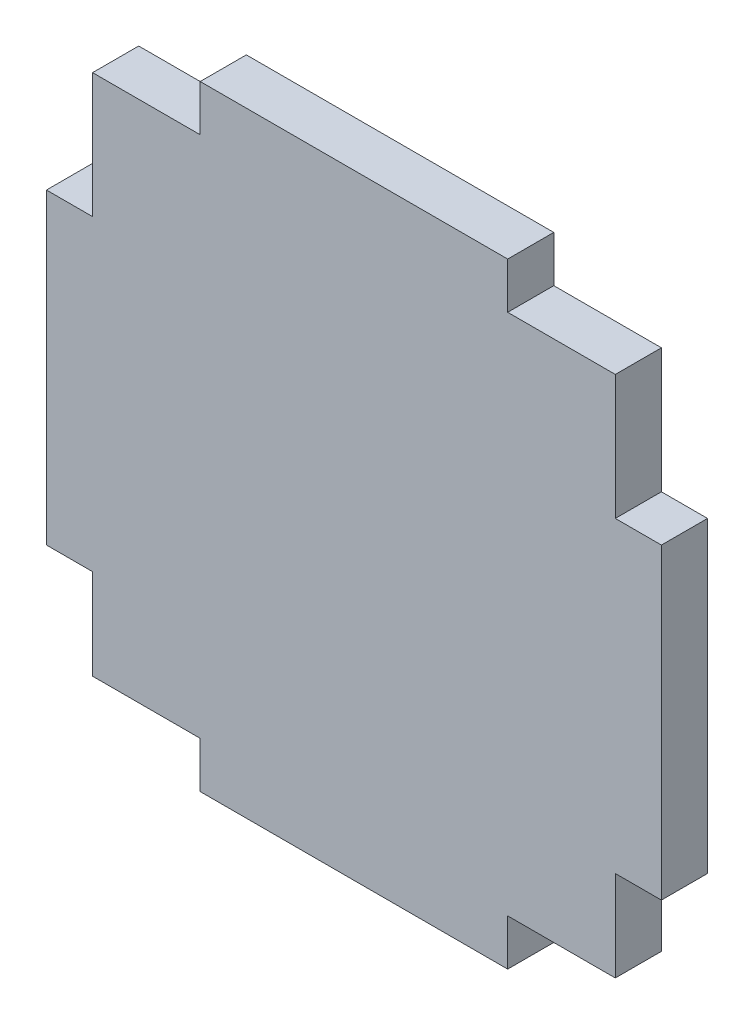
ISO-10303-21;
HEADER;
FILE_DESCRIPTION(('STEP AP214'),'2;1');
FILE_NAME('part.step','',(''),(''),'','','');
FILE_SCHEMA(('AUTOMOTIVE_DESIGN { 1 0 10303 214 1 1 1 1 }'));
ENDSEC;
DATA;
#1=APPLICATION_CONTEXT('core data for automotive mechanical design processes');
#2=APPLICATION_PROTOCOL_DEFINITION('international standard','automotive_design',2000,#1);
#3=PRODUCT_CONTEXT('',#1,'mechanical');
#4=PRODUCT('Part','Part','',(#3));
#5=PRODUCT_RELATED_PRODUCT_CATEGORY('part','',(#4));
#6=PRODUCT_DEFINITION_FORMATION('','',#4);
#7=PRODUCT_DEFINITION_CONTEXT('part definition',#1,'design');
#8=PRODUCT_DEFINITION('design','',#6,#7);
#9=PRODUCT_DEFINITION_SHAPE('','',#8);
#10=(LENGTH_UNIT() NAMED_UNIT(*) SI_UNIT(.MILLI.,.METRE.));
#11=(NAMED_UNIT(*) PLANE_ANGLE_UNIT() SI_UNIT($,.RADIAN.));
#12=(NAMED_UNIT(*) SI_UNIT($,.STERADIAN.) SOLID_ANGLE_UNIT());
#13=UNCERTAINTY_MEASURE_WITH_UNIT(LENGTH_MEASURE(1.E-05),#10,'distance_accuracy_value','');
#14=(GEOMETRIC_REPRESENTATION_CONTEXT(3) GLOBAL_UNCERTAINTY_ASSIGNED_CONTEXT((#13)) GLOBAL_UNIT_ASSIGNED_CONTEXT((#10,
#11,#12)) REPRESENTATION_CONTEXT('',''));
#15=CARTESIAN_POINT('',(0.,0.,0.));
#16=DIRECTION('',(0.,0.,1.));
#17=DIRECTION('',(1.,0.,0.));
#18=AXIS2_PLACEMENT_3D('',#15,#16,#17);
#19=CARTESIAN_POINT('',(103.773892478663,-53.6986126238286,3.));
#20=DIRECTION('',(0.,1.,0.));
#21=DIRECTION('',(0.,0.,1.));
#22=AXIS2_PLACEMENT_3D('',#19,#20,#21);
#23=PLANE('',#22);
#24=DIRECTION('',(1.,0.,0.));
#25=VECTOR('',#24,1.);
#26=CARTESIAN_POINT('',(103.773892478663,-53.6986126238286,0.));
#27=LINE('',#26,#25);
#28=CARTESIAN_POINT('',(103.773892478663,-53.6986126238286,0.));
#29=VERTEX_POINT('',#28);
#30=CARTESIAN_POINT('',(110.773892478663,-53.6986126238286,0.));
#31=VERTEX_POINT('',#30);
#32=EDGE_CURVE('E205',#29,#31,#27,.T.);
#33=ORIENTED_EDGE('',*,*,#32,.T.);
#34=DIRECTION('',(0.,0.,-1.));
#35=VECTOR('',#34,1.);
#36=CARTESIAN_POINT('',(110.773892478663,-53.6986126238286,3.));
#37=LINE('',#36,#35);
#38=CARTESIAN_POINT('',(110.773892478663,-53.6986126238286,3.));
#39=VERTEX_POINT('',#38);
#40=EDGE_CURVE('E11',#39,#31,#37,.T.);
#41=ORIENTED_EDGE('',*,*,#40,.F.);
#42=DIRECTION('',(1.,0.,0.));
#43=VECTOR('',#42,1.);
#44=CARTESIAN_POINT('',(103.773892478663,-53.6986126238286,3.));
#45=LINE('',#44,#43);
#46=CARTESIAN_POINT('',(103.773892478663,-53.6986126238286,3.));
#47=VERTEX_POINT('',#46);
#48=EDGE_CURVE('E243',#47,#39,#45,.T.);
#49=ORIENTED_EDGE('',*,*,#48,.F.);
#50=DIRECTION('',(0.,0.,-1.));
#51=VECTOR('',#50,1.);
#52=CARTESIAN_POINT('',(103.773892478663,-53.6986126238286,3.));
#53=LINE('',#52,#51);
#54=EDGE_CURVE('E201',#47,#29,#53,.T.);
#55=ORIENTED_EDGE('',*,*,#54,.T.);
#56=EDGE_LOOP('',(#33,#41,#49,#55));
#57=FACE_BOUND('',#56,.T.);
#58=ADVANCED_FACE('F37',(#57),#23,.F.);
#59=CARTESIAN_POINT('',(110.773892478663,-47.8105206645095,3.));
#60=DIRECTION('',(-1.,0.,0.));
#61=DIRECTION('',(0.,0.,1.));
#62=AXIS2_PLACEMENT_3D('',#59,#60,#61);
#63=PLANE('',#62);
#64=DIRECTION('',(0.,1.,0.));
#65=VECTOR('',#64,1.);
#66=CARTESIAN_POINT('',(110.773892478663,-47.8105206645095,0.));
#67=LINE('',#66,#65);
#68=CARTESIAN_POINT('',(110.773892478663,-47.8105206645095,0.));
#69=VERTEX_POINT('',#68);
#70=EDGE_CURVE('E208',#31,#69,#67,.T.);
#71=ORIENTED_EDGE('',*,*,#70,.T.);
#72=DIRECTION('',(0.,0.,-1.));
#73=VECTOR('',#72,1.);
#74=CARTESIAN_POINT('',(110.773892478663,-47.8105206645095,3.));
#75=LINE('',#74,#73);
#76=CARTESIAN_POINT('',(110.773892478663,-47.8105206645095,3.));
#77=VERTEX_POINT('',#76);
#78=EDGE_CURVE('E45',#77,#69,#75,.T.);
#79=ORIENTED_EDGE('',*,*,#78,.F.);
#80=DIRECTION('',(0.,1.,0.));
#81=VECTOR('',#80,1.);
#82=CARTESIAN_POINT('',(110.773892478663,-47.8105206645095,3.));
#83=LINE('',#82,#81);
#84=EDGE_CURVE('E132',#39,#77,#83,.T.);
#85=ORIENTED_EDGE('',*,*,#84,.F.);
#86=ORIENTED_EDGE('',*,*,#40,.T.);
#87=EDGE_LOOP('',(#71,#79,#85,#86));
#88=FACE_BOUND('',#87,.T.);
#89=ADVANCED_FACE('F361',(#88),#63,.F.);
#90=CARTESIAN_POINT('',(113.773892478663,-47.8105206645095,3.));
#91=DIRECTION('',(0.,1.,0.));
#92=DIRECTION('',(-1.,0.,0.));
#93=AXIS2_PLACEMENT_3D('',#90,#91,#92);
#94=PLANE('',#93);
#95=DIRECTION('',(1.,0.,0.));
#96=VECTOR('',#95,1.);
#97=CARTESIAN_POINT('',(113.773892478663,-47.8105206645095,0.));
#98=LINE('',#97,#96);
#99=CARTESIAN_POINT('',(113.773892478663,-47.8105206645095,0.));
#100=VERTEX_POINT('',#99);
#101=EDGE_CURVE('E210',#69,#100,#98,.T.);
#102=ORIENTED_EDGE('',*,*,#101,.T.);
#103=DIRECTION('',(0.,0.,-1.));
#104=VECTOR('',#103,1.);
#105=CARTESIAN_POINT('',(113.773892478663,-47.8105206645095,3.));
#106=LINE('',#105,#104);
#107=CARTESIAN_POINT('',(113.773892478663,-47.8105206645095,3.));
#108=VERTEX_POINT('',#107);
#109=EDGE_CURVE('E286',#108,#100,#106,.T.);
#110=ORIENTED_EDGE('',*,*,#109,.F.);
#111=DIRECTION('',(1.,0.,0.));
#112=VECTOR('',#111,1.);
#113=CARTESIAN_POINT('',(113.773892478663,-47.8105206645095,3.));
#114=LINE('',#113,#112);
#115=EDGE_CURVE('E294',#77,#108,#114,.T.);
#116=ORIENTED_EDGE('',*,*,#115,.F.);
#117=ORIENTED_EDGE('',*,*,#78,.T.);
#118=EDGE_LOOP('',(#102,#110,#116,#117));
#119=FACE_BOUND('',#118,.T.);
#120=ADVANCED_FACE('F292',(#119),#94,.F.);
#121=CARTESIAN_POINT('',(113.773892478663,-27.8105206645095,3.));
#122=DIRECTION('',(-1.,0.,0.));
#123=DIRECTION('',(0.,0.,1.));
#124=AXIS2_PLACEMENT_3D('',#121,#122,#123);
#125=PLANE('',#124);
#126=DIRECTION('',(0.,1.,0.));
#127=VECTOR('',#126,1.);
#128=CARTESIAN_POINT('',(113.773892478663,-27.8105206645095,0.));
#129=LINE('',#128,#127);
#130=CARTESIAN_POINT('',(113.773892478663,-27.8105206645095,0.));
#131=VERTEX_POINT('',#130);
#132=EDGE_CURVE('E212',#100,#131,#129,.T.);
#133=ORIENTED_EDGE('',*,*,#132,.T.);
#134=DIRECTION('',(0.,0.,-1.));
#135=VECTOR('',#134,1.);
#136=CARTESIAN_POINT('',(113.773892478663,-27.8105206645095,3.));
#137=LINE('',#136,#135);
#138=CARTESIAN_POINT('',(113.773892478663,-27.8105206645095,3.));
#139=VERTEX_POINT('',#138);
#140=EDGE_CURVE('E283',#139,#131,#137,.T.);
#141=ORIENTED_EDGE('',*,*,#140,.F.);
#142=DIRECTION('',(0.,1.,0.));
#143=VECTOR('',#142,1.);
#144=CARTESIAN_POINT('',(113.773892478663,-27.8105206645095,3.));
#145=LINE('',#144,#143);
#146=EDGE_CURVE('E312',#108,#139,#145,.T.);
#147=ORIENTED_EDGE('',*,*,#146,.F.);
#148=ORIENTED_EDGE('',*,*,#109,.T.);
#149=EDGE_LOOP('',(#133,#141,#147,#148));
#150=FACE_BOUND('',#149,.T.);
#151=ADVANCED_FACE('F303',(#150),#125,.F.);
#152=CARTESIAN_POINT('',(113.773892478663,-27.8105206645095,3.));
#153=DIRECTION('',(0.,-1.,0.));
#154=DIRECTION('',(0.,0.,-1.));
#155=AXIS2_PLACEMENT_3D('',#152,#153,#154);
#156=PLANE('',#155);
#157=DIRECTION('',(-1.,0.,0.));
#158=VECTOR('',#157,1.);
#159=CARTESIAN_POINT('',(113.773892478663,-27.8105206645095,0.));
#160=LINE('',#159,#158);
#161=CARTESIAN_POINT('',(110.773892478663,-27.8105206645095,0.));
#162=VERTEX_POINT('',#161);
#163=EDGE_CURVE('E214',#131,#162,#160,.T.);
#164=ORIENTED_EDGE('',*,*,#163,.T.);
#165=DIRECTION('',(0.,0.,-1.));
#166=VECTOR('',#165,1.);
#167=CARTESIAN_POINT('',(110.773892478663,-27.8105206645095,3.));
#168=LINE('',#167,#166);
#169=CARTESIAN_POINT('',(110.773892478663,-27.8105206645095,3.));
#170=VERTEX_POINT('',#169);
#171=EDGE_CURVE('E280',#170,#162,#168,.T.);
#172=ORIENTED_EDGE('',*,*,#171,.F.);
#173=DIRECTION('',(-1.,0.,0.));
#174=VECTOR('',#173,1.);
#175=CARTESIAN_POINT('',(113.773892478663,-27.8105206645095,3.));
#176=LINE('',#175,#174);
#177=EDGE_CURVE('E309',#139,#170,#176,.T.);
#178=ORIENTED_EDGE('',*,*,#177,.F.);
#179=ORIENTED_EDGE('',*,*,#140,.T.);
#180=EDGE_LOOP('',(#164,#172,#178,#179));
#181=FACE_BOUND('',#180,.T.);
#182=ADVANCED_FACE('F307',(#181),#156,.F.);
#183=CARTESIAN_POINT('',(110.773892478663,-19.6986126238286,3.));
#184=DIRECTION('',(-1.,0.,0.));
#185=DIRECTION('',(0.,0.,1.));
#186=AXIS2_PLACEMENT_3D('',#183,#184,#185);
#187=PLANE('',#186);
#188=DIRECTION('',(0.,1.,0.));
#189=VECTOR('',#188,1.);
#190=CARTESIAN_POINT('',(110.773892478663,-19.6986126238286,0.));
#191=LINE('',#190,#189);
#192=CARTESIAN_POINT('',(110.773892478663,-19.6986126238286,0.));
#193=VERTEX_POINT('',#192);
#194=EDGE_CURVE('E216',#162,#193,#191,.T.);
#195=ORIENTED_EDGE('',*,*,#194,.T.);
#196=DIRECTION('',(0.,0.,-1.));
#197=VECTOR('',#196,1.);
#198=CARTESIAN_POINT('',(110.773892478663,-19.6986126238286,3.));
#199=LINE('',#198,#197);
#200=CARTESIAN_POINT('',(110.773892478663,-19.6986126238286,3.));
#201=VERTEX_POINT('',#200);
#202=EDGE_CURVE('E277',#201,#193,#199,.T.);
#203=ORIENTED_EDGE('',*,*,#202,.F.);
#204=DIRECTION('',(0.,1.,0.));
#205=VECTOR('',#204,1.);
#206=CARTESIAN_POINT('',(110.773892478663,-19.6986126238286,3.));
#207=LINE('',#206,#205);
#208=EDGE_CURVE('E311',#170,#201,#207,.T.);
#209=ORIENTED_EDGE('',*,*,#208,.F.);
#210=ORIENTED_EDGE('',*,*,#171,.T.);
#211=EDGE_LOOP('',(#195,#203,#209,#210));
#212=FACE_BOUND('',#211,.T.);
#213=ADVANCED_FACE('F374',(#212),#187,.F.);
#214=CARTESIAN_POINT('',(103.773892478663,-19.6986126238286,3.));
#215=DIRECTION('',(0.,-1.,0.));
#216=DIRECTION('',(0.,0.,-1.));
#217=AXIS2_PLACEMENT_3D('',#214,#215,#216);
#218=PLANE('',#217);
#219=DIRECTION('',(-1.,0.,0.));
#220=VECTOR('',#219,1.);
#221=CARTESIAN_POINT('',(103.773892478663,-19.6986126238286,0.));
#222=LINE('',#221,#220);
#223=CARTESIAN_POINT('',(103.773892478663,-19.6986126238286,0.));
#224=VERTEX_POINT('',#223);
#225=EDGE_CURVE('E218',#193,#224,#222,.T.);
#226=ORIENTED_EDGE('',*,*,#225,.T.);
#227=DIRECTION('',(0.,0.,-1.));
#228=VECTOR('',#227,1.);
#229=CARTESIAN_POINT('',(103.773892478663,-19.6986126238286,3.));
#230=LINE('',#229,#228);
#231=CARTESIAN_POINT('',(103.773892478663,-19.6986126238286,3.));
#232=VERTEX_POINT('',#231);
#233=EDGE_CURVE('E274',#232,#224,#230,.T.);
#234=ORIENTED_EDGE('',*,*,#233,.F.);
#235=DIRECTION('',(-1.,0.,0.));
#236=VECTOR('',#235,1.);
#237=CARTESIAN_POINT('',(103.773892478663,-19.6986126238286,3.));
#238=LINE('',#237,#236);
#239=EDGE_CURVE('E314',#201,#232,#238,.T.);
#240=ORIENTED_EDGE('',*,*,#239,.F.);
#241=ORIENTED_EDGE('',*,*,#202,.T.);
#242=EDGE_LOOP('',(#226,#234,#240,#241));
#243=FACE_BOUND('',#242,.T.);
#244=ADVANCED_FACE('F377',(#243),#218,.F.);
#245=CARTESIAN_POINT('',(103.773892478663,-19.6986126238286,3.));
#246=DIRECTION('',(-1.,0.,0.));
#247=DIRECTION('',(0.,0.,1.));
#248=AXIS2_PLACEMENT_3D('',#245,#246,#247);
#249=PLANE('',#248);
#250=DIRECTION('',(0.,1.,0.));
#251=VECTOR('',#250,1.);
#252=CARTESIAN_POINT('',(103.773892478663,-19.6986126238286,0.));
#253=LINE('',#252,#251);
#254=CARTESIAN_POINT('',(103.773892478663,-16.6986126238286,0.));
#255=VERTEX_POINT('',#254);
#256=EDGE_CURVE('E220',#224,#255,#253,.T.);
#257=ORIENTED_EDGE('',*,*,#256,.T.);
#258=DIRECTION('',(0.,0.,-1.));
#259=VECTOR('',#258,1.);
#260=CARTESIAN_POINT('',(103.773892478663,-16.6986126238286,3.));
#261=LINE('',#260,#259);
#262=CARTESIAN_POINT('',(103.773892478663,-16.6986126238286,3.));
#263=VERTEX_POINT('',#262);
#264=EDGE_CURVE('E271',#263,#255,#261,.T.);
#265=ORIENTED_EDGE('',*,*,#264,.F.);
#266=DIRECTION('',(0.,1.,0.));
#267=VECTOR('',#266,1.);
#268=CARTESIAN_POINT('',(103.773892478663,-19.6986126238286,3.));
#269=LINE('',#268,#267);
#270=EDGE_CURVE('E320',#232,#263,#269,.T.);
#271=ORIENTED_EDGE('',*,*,#270,.F.);
#272=ORIENTED_EDGE('',*,*,#233,.T.);
#273=EDGE_LOOP('',(#257,#265,#271,#272));
#274=FACE_BOUND('',#273,.T.);
#275=ADVANCED_FACE('F381',(#274),#249,.F.);
#276=CARTESIAN_POINT('',(83.7738924786629,-16.6986126238286,3.));
#277=DIRECTION('',(0.,-1.,0.));
#278=DIRECTION('',(1.,0.,0.));
#279=AXIS2_PLACEMENT_3D('',#276,#277,#278);
#280=PLANE('',#279);
#281=DIRECTION('',(-1.,0.,0.));
#282=VECTOR('',#281,1.);
#283=CARTESIAN_POINT('',(83.7738924786629,-16.6986126238286,0.));
#284=LINE('',#283,#282);
#285=CARTESIAN_POINT('',(83.7738924786629,-16.6986126238286,0.));
#286=VERTEX_POINT('',#285);
#287=EDGE_CURVE('E222',#255,#286,#284,.T.);
#288=ORIENTED_EDGE('',*,*,#287,.T.);
#289=DIRECTION('',(0.,0.,-1.));
#290=VECTOR('',#289,1.);
#291=CARTESIAN_POINT('',(83.7738924786629,-16.6986126238286,3.));
#292=LINE('',#291,#290);
#293=CARTESIAN_POINT('',(83.7738924786629,-16.6986126238286,3.));
#294=VERTEX_POINT('',#293);
#295=EDGE_CURVE('E268',#294,#286,#292,.T.);
#296=ORIENTED_EDGE('',*,*,#295,.F.);
#297=DIRECTION('',(-1.,0.,0.));
#298=VECTOR('',#297,1.);
#299=CARTESIAN_POINT('',(83.7738924786629,-16.6986126238286,3.));
#300=LINE('',#299,#298);
#301=EDGE_CURVE('E322',#263,#294,#300,.T.);
#302=ORIENTED_EDGE('',*,*,#301,.F.);
#303=ORIENTED_EDGE('',*,*,#264,.T.);
#304=EDGE_LOOP('',(#288,#296,#302,#303));
#305=FACE_BOUND('',#304,.T.);
#306=ADVANCED_FACE('F385',(#305),#280,.F.);
#307=CARTESIAN_POINT('',(83.7738924786629,-19.6986126238286,3.));
#308=DIRECTION('',(1.,0.,0.));
#309=DIRECTION('',(0.,0.,-1.));
#310=AXIS2_PLACEMENT_3D('',#307,#308,#309);
#311=PLANE('',#310);
#312=DIRECTION('',(0.,-1.,0.));
#313=VECTOR('',#312,1.);
#314=CARTESIAN_POINT('',(83.7738924786629,-19.6986126238286,0.));
#315=LINE('',#314,#313);
#316=CARTESIAN_POINT('',(83.7738924786629,-19.6986126238286,0.));
#317=VERTEX_POINT('',#316);
#318=EDGE_CURVE('E224',#286,#317,#315,.T.);
#319=ORIENTED_EDGE('',*,*,#318,.T.);
#320=DIRECTION('',(0.,0.,-1.));
#321=VECTOR('',#320,1.);
#322=CARTESIAN_POINT('',(83.7738924786629,-19.6986126238286,3.));
#323=LINE('',#322,#321);
#324=CARTESIAN_POINT('',(83.7738924786629,-19.6986126238286,3.));
#325=VERTEX_POINT('',#324);
#326=EDGE_CURVE('E265',#325,#317,#323,.T.);
#327=ORIENTED_EDGE('',*,*,#326,.F.);
#328=DIRECTION('',(0.,-1.,0.));
#329=VECTOR('',#328,1.);
#330=CARTESIAN_POINT('',(83.7738924786629,-19.6986126238286,3.));
#331=LINE('',#330,#329);
#332=EDGE_CURVE('E324',#294,#325,#331,.T.);
#333=ORIENTED_EDGE('',*,*,#332,.F.);
#334=ORIENTED_EDGE('',*,*,#295,.T.);
#335=EDGE_LOOP('',(#319,#327,#333,#334));
#336=FACE_BOUND('',#335,.T.);
#337=ADVANCED_FACE('F389',(#336),#311,.F.);
#338=CARTESIAN_POINT('',(76.7738924786629,-19.6986126238286,3.));
#339=DIRECTION('',(0.,-1.,0.));
#340=DIRECTION('',(0.,0.,-1.));
#341=AXIS2_PLACEMENT_3D('',#338,#339,#340);
#342=PLANE('',#341);
#343=DIRECTION('',(-1.,0.,0.));
#344=VECTOR('',#343,1.);
#345=CARTESIAN_POINT('',(76.7738924786629,-19.6986126238286,0.));
#346=LINE('',#345,#344);
#347=CARTESIAN_POINT('',(76.7738924786629,-19.6986126238286,0.));
#348=VERTEX_POINT('',#347);
#349=EDGE_CURVE('E226',#317,#348,#346,.T.);
#350=ORIENTED_EDGE('',*,*,#349,.T.);
#351=DIRECTION('',(0.,0.,-1.));
#352=VECTOR('',#351,1.);
#353=CARTESIAN_POINT('',(76.7738924786629,-19.6986126238286,3.));
#354=LINE('',#353,#352);
#355=CARTESIAN_POINT('',(76.7738924786629,-19.6986126238286,3.));
#356=VERTEX_POINT('',#355);
#357=EDGE_CURVE('E262',#356,#348,#354,.T.);
#358=ORIENTED_EDGE('',*,*,#357,.F.);
#359=DIRECTION('',(-1.,0.,0.));
#360=VECTOR('',#359,1.);
#361=CARTESIAN_POINT('',(76.7738924786629,-19.6986126238286,3.));
#362=LINE('',#361,#360);
#363=EDGE_CURVE('E326',#325,#356,#362,.T.);
#364=ORIENTED_EDGE('',*,*,#363,.F.);
#365=ORIENTED_EDGE('',*,*,#326,.T.);
#366=EDGE_LOOP('',(#350,#358,#364,#365));
#367=FACE_BOUND('',#366,.T.);
#368=ADVANCED_FACE('F393',(#367),#342,.F.);
#369=CARTESIAN_POINT('',(76.7738924786629,-27.8105206645095,3.));
#370=DIRECTION('',(1.,0.,0.));
#371=DIRECTION('',(0.,0.,-1.));
#372=AXIS2_PLACEMENT_3D('',#369,#370,#371);
#373=PLANE('',#372);
#374=DIRECTION('',(0.,-1.,0.));
#375=VECTOR('',#374,1.);
#376=CARTESIAN_POINT('',(76.7738924786629,-27.8105206645095,0.));
#377=LINE('',#376,#375);
#378=CARTESIAN_POINT('',(76.7738924786629,-27.8105206645095,0.));
#379=VERTEX_POINT('',#378);
#380=EDGE_CURVE('E228',#348,#379,#377,.T.);
#381=ORIENTED_EDGE('',*,*,#380,.T.);
#382=DIRECTION('',(0.,0.,-1.));
#383=VECTOR('',#382,1.);
#384=CARTESIAN_POINT('',(76.7738924786629,-27.8105206645095,3.));
#385=LINE('',#384,#383);
#386=CARTESIAN_POINT('',(76.7738924786629,-27.8105206645095,3.));
#387=VERTEX_POINT('',#386);
#388=EDGE_CURVE('E259',#387,#379,#385,.T.);
#389=ORIENTED_EDGE('',*,*,#388,.F.);
#390=DIRECTION('',(0.,-1.,0.));
#391=VECTOR('',#390,1.);
#392=CARTESIAN_POINT('',(76.7738924786629,-27.8105206645095,3.));
#393=LINE('',#392,#391);
#394=EDGE_CURVE('E328',#356,#387,#393,.T.);
#395=ORIENTED_EDGE('',*,*,#394,.F.);
#396=ORIENTED_EDGE('',*,*,#357,.T.);
#397=EDGE_LOOP('',(#381,#389,#395,#396));
#398=FACE_BOUND('',#397,.T.);
#399=ADVANCED_FACE('F397',(#398),#373,.F.);
#400=CARTESIAN_POINT('',(73.7738924786629,-27.8105206645095,3.));
#401=DIRECTION('',(0.,-1.,0.));
#402=DIRECTION('',(0.,0.,-1.));
#403=AXIS2_PLACEMENT_3D('',#400,#401,#402);
#404=PLANE('',#403);
#405=DIRECTION('',(-1.,0.,0.));
#406=VECTOR('',#405,1.);
#407=CARTESIAN_POINT('',(73.7738924786629,-27.8105206645095,0.));
#408=LINE('',#407,#406);
#409=CARTESIAN_POINT('',(73.7738924786629,-27.8105206645095,0.));
#410=VERTEX_POINT('',#409);
#411=EDGE_CURVE('E230',#379,#410,#408,.T.);
#412=ORIENTED_EDGE('',*,*,#411,.T.);
#413=DIRECTION('',(0.,0.,-1.));
#414=VECTOR('',#413,1.);
#415=CARTESIAN_POINT('',(73.7738924786629,-27.8105206645095,3.));
#416=LINE('',#415,#414);
#417=CARTESIAN_POINT('',(73.7738924786629,-27.8105206645095,3.));
#418=VERTEX_POINT('',#417);
#419=EDGE_CURVE('E256',#418,#410,#416,.T.);
#420=ORIENTED_EDGE('',*,*,#419,.F.);
#421=DIRECTION('',(-1.,0.,0.));
#422=VECTOR('',#421,1.);
#423=CARTESIAN_POINT('',(73.7738924786629,-27.8105206645095,3.));
#424=LINE('',#423,#422);
#425=EDGE_CURVE('E330',#387,#418,#424,.T.);
#426=ORIENTED_EDGE('',*,*,#425,.F.);
#427=ORIENTED_EDGE('',*,*,#388,.T.);
#428=EDGE_LOOP('',(#412,#420,#426,#427));
#429=FACE_BOUND('',#428,.T.);
#430=ADVANCED_FACE('F401',(#429),#404,.F.);
#431=CARTESIAN_POINT('',(73.7738924786629,-27.8105206645095,3.));
#432=DIRECTION('',(1.,0.,0.));
#433=DIRECTION('',(0.,0.,-1.));
#434=AXIS2_PLACEMENT_3D('',#431,#432,#433);
#435=PLANE('',#434);
#436=DIRECTION('',(0.,-1.,0.));
#437=VECTOR('',#436,1.);
#438=CARTESIAN_POINT('',(73.7738924786629,-27.8105206645095,0.));
#439=LINE('',#438,#437);
#440=CARTESIAN_POINT('',(73.7738924786629,-47.8105206645095,0.));
#441=VERTEX_POINT('',#440);
#442=EDGE_CURVE('E232',#410,#441,#439,.T.);
#443=ORIENTED_EDGE('',*,*,#442,.T.);
#444=DIRECTION('',(0.,0.,-1.));
#445=VECTOR('',#444,1.);
#446=CARTESIAN_POINT('',(73.7738924786629,-47.8105206645095,3.));
#447=LINE('',#446,#445);
#448=CARTESIAN_POINT('',(73.7738924786629,-47.8105206645095,3.));
#449=VERTEX_POINT('',#448);
#450=EDGE_CURVE('E253',#449,#441,#447,.T.);
#451=ORIENTED_EDGE('',*,*,#450,.F.);
#452=DIRECTION('',(0.,-1.,0.));
#453=VECTOR('',#452,1.);
#454=CARTESIAN_POINT('',(73.7738924786629,-27.8105206645095,3.));
#455=LINE('',#454,#453);
#456=EDGE_CURVE('E332',#418,#449,#455,.T.);
#457=ORIENTED_EDGE('',*,*,#456,.F.);
#458=ORIENTED_EDGE('',*,*,#419,.T.);
#459=EDGE_LOOP('',(#443,#451,#457,#458));
#460=FACE_BOUND('',#459,.T.);
#461=ADVANCED_FACE('F405',(#460),#435,.F.);
#462=CARTESIAN_POINT('',(73.7738924786629,-47.8105206645095,3.));
#463=DIRECTION('',(0.,1.,0.));
#464=DIRECTION('',(0.,0.,1.));
#465=AXIS2_PLACEMENT_3D('',#462,#463,#464);
#466=PLANE('',#465);
#467=DIRECTION('',(1.,0.,0.));
#468=VECTOR('',#467,1.);
#469=CARTESIAN_POINT('',(73.7738924786629,-47.8105206645095,0.));
#470=LINE('',#469,#468);
#471=CARTESIAN_POINT('',(76.7738924786629,-47.8105206645095,0.));
#472=VERTEX_POINT('',#471);
#473=EDGE_CURVE('E234',#441,#472,#470,.T.);
#474=ORIENTED_EDGE('',*,*,#473,.T.);
#475=DIRECTION('',(0.,0.,-1.));
#476=VECTOR('',#475,1.);
#477=CARTESIAN_POINT('',(76.7738924786629,-47.8105206645095,3.));
#478=LINE('',#477,#476);
#479=CARTESIAN_POINT('',(76.7738924786629,-47.8105206645095,3.));
#480=VERTEX_POINT('',#479);
#481=EDGE_CURVE('E250',#480,#472,#478,.T.);
#482=ORIENTED_EDGE('',*,*,#481,.F.);
#483=DIRECTION('',(1.,0.,0.));
#484=VECTOR('',#483,1.);
#485=CARTESIAN_POINT('',(73.7738924786629,-47.8105206645095,3.));
#486=LINE('',#485,#484);
#487=EDGE_CURVE('E334',#449,#480,#486,.T.);
#488=ORIENTED_EDGE('',*,*,#487,.F.);
#489=ORIENTED_EDGE('',*,*,#450,.T.);
#490=EDGE_LOOP('',(#474,#482,#488,#489));
#491=FACE_BOUND('',#490,.T.);
#492=ADVANCED_FACE('F409',(#491),#466,.F.);
#493=CARTESIAN_POINT('',(76.7738924786629,-47.8105206645095,3.));
#494=DIRECTION('',(1.,0.,0.));
#495=DIRECTION('',(0.,0.,-1.));
#496=AXIS2_PLACEMENT_3D('',#493,#494,#495);
#497=PLANE('',#496);
#498=DIRECTION('',(0.,-1.,0.));
#499=VECTOR('',#498,1.);
#500=CARTESIAN_POINT('',(76.7738924786629,-47.8105206645095,0.));
#501=LINE('',#500,#499);
#502=CARTESIAN_POINT('',(76.7738924786629,-53.6986126238286,0.));
#503=VERTEX_POINT('',#502);
#504=EDGE_CURVE('E236',#472,#503,#501,.T.);
#505=ORIENTED_EDGE('',*,*,#504,.T.);
#506=DIRECTION('',(0.,0.,-1.));
#507=VECTOR('',#506,1.);
#508=CARTESIAN_POINT('',(76.7738924786629,-53.6986126238286,3.));
#509=LINE('',#508,#507);
#510=CARTESIAN_POINT('',(76.7738924786629,-53.6986126238286,3.));
#511=VERTEX_POINT('',#510);
#512=EDGE_CURVE('E247',#511,#503,#509,.T.);
#513=ORIENTED_EDGE('',*,*,#512,.F.);
#514=DIRECTION('',(0.,-1.,0.));
#515=VECTOR('',#514,1.);
#516=CARTESIAN_POINT('',(76.7738924786629,-47.8105206645095,3.));
#517=LINE('',#516,#515);
#518=EDGE_CURVE('E336',#480,#511,#517,.T.);
#519=ORIENTED_EDGE('',*,*,#518,.F.);
#520=ORIENTED_EDGE('',*,*,#481,.T.);
#521=EDGE_LOOP('',(#505,#513,#519,#520));
#522=FACE_BOUND('',#521,.T.);
#523=ADVANCED_FACE('F342',(#522),#497,.F.);
#524=CARTESIAN_POINT('',(76.7738924786629,-53.6986126238286,3.));
#525=DIRECTION('',(0.,1.,0.));
#526=DIRECTION('',(0.,0.,1.));
#527=AXIS2_PLACEMENT_3D('',#524,#525,#526);
#528=PLANE('',#527);
#529=DIRECTION('',(1.,0.,0.));
#530=VECTOR('',#529,1.);
#531=CARTESIAN_POINT('',(76.7738924786629,-53.6986126238286,0.));
#532=LINE('',#531,#530);
#533=CARTESIAN_POINT('',(83.7738924786629,-53.6986126238286,0.));
#534=VERTEX_POINT('',#533);
#535=EDGE_CURVE('E238',#503,#534,#532,.T.);
#536=ORIENTED_EDGE('',*,*,#535,.T.);
#537=DIRECTION('',(0.,0.,-1.));
#538=VECTOR('',#537,1.);
#539=CARTESIAN_POINT('',(83.7738924786629,-53.6986126238286,3.));
#540=LINE('',#539,#538);
#541=CARTESIAN_POINT('',(83.7738924786629,-53.6986126238286,3.));
#542=VERTEX_POINT('',#541);
#543=EDGE_CURVE('E196',#542,#534,#540,.T.);
#544=ORIENTED_EDGE('',*,*,#543,.F.);
#545=DIRECTION('',(1.,0.,0.));
#546=VECTOR('',#545,1.);
#547=CARTESIAN_POINT('',(76.7738924786629,-53.6986126238286,3.));
#548=LINE('',#547,#546);
#549=EDGE_CURVE('E187',#511,#542,#548,.T.);
#550=ORIENTED_EDGE('',*,*,#549,.F.);
#551=ORIENTED_EDGE('',*,*,#512,.T.);
#552=EDGE_LOOP('',(#536,#544,#550,#551));
#553=FACE_BOUND('',#552,.T.);
#554=ADVANCED_FACE('F346',(#553),#528,.F.);
#555=CARTESIAN_POINT('',(83.7738924786629,-53.6986126238286,3.));
#556=DIRECTION('',(1.,0.,0.));
#557=DIRECTION('',(0.,0.,-1.));
#558=AXIS2_PLACEMENT_3D('',#555,#556,#557);
#559=PLANE('',#558);
#560=DIRECTION('',(0.,-1.,0.));
#561=VECTOR('',#560,1.);
#562=CARTESIAN_POINT('',(83.7738924786629,-53.6986126238286,0.));
#563=LINE('',#562,#561);
#564=CARTESIAN_POINT('',(83.7738924786629,-56.6986126238286,0.));
#565=VERTEX_POINT('',#564);
#566=EDGE_CURVE('E195',#534,#565,#563,.T.);
#567=ORIENTED_EDGE('',*,*,#566,.T.);
#568=DIRECTION('',(0.,0.,-1.));
#569=VECTOR('',#568,1.);
#570=CARTESIAN_POINT('',(83.7738924786629,-56.6986126238286,3.));
#571=LINE('',#570,#569);
#572=CARTESIAN_POINT('',(83.7738924786629,-56.6986126238286,3.));
#573=VERTEX_POINT('',#572);
#574=EDGE_CURVE('E192',#573,#565,#571,.T.);
#575=ORIENTED_EDGE('',*,*,#574,.F.);
#576=DIRECTION('',(0.,-1.,0.));
#577=VECTOR('',#576,1.);
#578=CARTESIAN_POINT('',(83.7738924786629,-53.6986126238286,3.));
#579=LINE('',#578,#577);
#580=EDGE_CURVE('E181',#542,#573,#579,.T.);
#581=ORIENTED_EDGE('',*,*,#580,.F.);
#582=ORIENTED_EDGE('',*,*,#543,.T.);
#583=EDGE_LOOP('',(#567,#575,#581,#582));
#584=FACE_BOUND('',#583,.T.);
#585=ADVANCED_FACE('F193',(#584),#559,.F.);
#586=CARTESIAN_POINT('',(83.7738924786629,-56.6986126238286,3.));
#587=DIRECTION('',(0.,1.,0.));
#588=DIRECTION('',(-1.,0.,0.));
#589=AXIS2_PLACEMENT_3D('',#586,#587,#588);
#590=PLANE('',#589);
#591=DIRECTION('',(1.,0.,0.));
#592=VECTOR('',#591,1.);
#593=CARTESIAN_POINT('',(83.7738924786629,-56.6986126238286,0.));
#594=LINE('',#593,#592);
#595=CARTESIAN_POINT('',(103.773892478663,-56.6986126238286,0.));
#596=VERTEX_POINT('',#595);
#597=EDGE_CURVE('E118',#565,#596,#594,.T.);
#598=ORIENTED_EDGE('',*,*,#597,.T.);
#599=DIRECTION('',(0.,0.,-1.));
#600=VECTOR('',#599,1.);
#601=CARTESIAN_POINT('',(103.773892478663,-56.6986126238286,3.));
#602=LINE('',#601,#600);
#603=CARTESIAN_POINT('',(103.773892478663,-56.6986126238286,3.));
#604=VERTEX_POINT('',#603);
#605=EDGE_CURVE('E197',#604,#596,#602,.T.);
#606=ORIENTED_EDGE('',*,*,#605,.F.);
#607=DIRECTION('',(1.,0.,0.));
#608=VECTOR('',#607,1.);
#609=CARTESIAN_POINT('',(83.7738924786629,-56.6986126238286,3.));
#610=LINE('',#609,#608);
#611=EDGE_CURVE('E185',#573,#604,#610,.T.);
#612=ORIENTED_EDGE('',*,*,#611,.F.);
#613=ORIENTED_EDGE('',*,*,#574,.T.);
#614=EDGE_LOOP('',(#598,#606,#612,#613));
#615=FACE_BOUND('',#614,.T.);
#616=ADVANCED_FACE('F199',(#615),#590,.F.);
#617=CARTESIAN_POINT('',(103.773892478663,-53.6986126238286,3.));
#618=DIRECTION('',(-1.,0.,0.));
#619=DIRECTION('',(0.,0.,1.));
#620=AXIS2_PLACEMENT_3D('',#617,#618,#619);
#621=PLANE('',#620);
#622=DIRECTION('',(0.,1.,0.));
#623=VECTOR('',#622,1.);
#624=CARTESIAN_POINT('',(103.773892478663,-53.6986126238286,0.));
#625=LINE('',#624,#623);
#626=EDGE_CURVE('E124',#596,#29,#625,.T.);
#627=ORIENTED_EDGE('',*,*,#626,.T.);
#628=ORIENTED_EDGE('',*,*,#54,.F.);
#629=DIRECTION('',(0.,1.,0.));
#630=VECTOR('',#629,1.);
#631=CARTESIAN_POINT('',(103.773892478663,-53.6986126238286,3.));
#632=LINE('',#631,#630);
#633=EDGE_CURVE('E53',#604,#47,#632,.T.);
#634=ORIENTED_EDGE('',*,*,#633,.F.);
#635=ORIENTED_EDGE('',*,*,#605,.T.);
#636=EDGE_LOOP('',(#627,#628,#634,#635));
#637=FACE_BOUND('',#636,.T.);
#638=ADVANCED_FACE('F350',(#637),#621,.F.);
#639=CARTESIAN_POINT('',(0.,0.,3.));
#640=DIRECTION('',(0.,0.,-1.));
#641=DIRECTION('',(-1.,0.,0.));
#642=AXIS2_PLACEMENT_3D('',#639,#640,#641);
#643=PLANE('',#642);
#644=ORIENTED_EDGE('',*,*,#48,.T.);
#645=ORIENTED_EDGE('',*,*,#84,.T.);
#646=ORIENTED_EDGE('',*,*,#115,.T.);
#647=ORIENTED_EDGE('',*,*,#146,.T.);
#648=ORIENTED_EDGE('',*,*,#177,.T.);
#649=ORIENTED_EDGE('',*,*,#208,.T.);
#650=ORIENTED_EDGE('',*,*,#239,.T.);
#651=ORIENTED_EDGE('',*,*,#270,.T.);
#652=ORIENTED_EDGE('',*,*,#301,.T.);
#653=ORIENTED_EDGE('',*,*,#332,.T.);
#654=ORIENTED_EDGE('',*,*,#363,.T.);
#655=ORIENTED_EDGE('',*,*,#394,.T.);
#656=ORIENTED_EDGE('',*,*,#425,.T.);
#657=ORIENTED_EDGE('',*,*,#456,.T.);
#658=ORIENTED_EDGE('',*,*,#487,.T.);
#659=ORIENTED_EDGE('',*,*,#518,.T.);
#660=ORIENTED_EDGE('',*,*,#549,.T.);
#661=ORIENTED_EDGE('',*,*,#580,.T.);
#662=ORIENTED_EDGE('',*,*,#611,.T.);
#663=ORIENTED_EDGE('',*,*,#633,.T.);
#664=EDGE_LOOP('',(#644,#645,#646,#647,#648,#649,#650,#651,#652,#653,#654,#655,#656,#657,#658,
#659,#660,#661,#662,#663));
#665=FACE_BOUND('',#664,.T.);
#666=ADVANCED_FACE('F183',(#665),#643,.F.);
#667=CARTESIAN_POINT('',(0.,0.,0.));
#668=DIRECTION('',(0.,0.,-1.));
#669=DIRECTION('',(-1.,0.,0.));
#670=AXIS2_PLACEMENT_3D('',#667,#668,#669);
#671=PLANE('',#670);
#672=ORIENTED_EDGE('',*,*,#32,.F.);
#673=ORIENTED_EDGE('',*,*,#626,.F.);
#674=ORIENTED_EDGE('',*,*,#597,.F.);
#675=ORIENTED_EDGE('',*,*,#566,.F.);
#676=ORIENTED_EDGE('',*,*,#535,.F.);
#677=ORIENTED_EDGE('',*,*,#504,.F.);
#678=ORIENTED_EDGE('',*,*,#473,.F.);
#679=ORIENTED_EDGE('',*,*,#442,.F.);
#680=ORIENTED_EDGE('',*,*,#411,.F.);
#681=ORIENTED_EDGE('',*,*,#380,.F.);
#682=ORIENTED_EDGE('',*,*,#349,.F.);
#683=ORIENTED_EDGE('',*,*,#318,.F.);
#684=ORIENTED_EDGE('',*,*,#287,.F.);
#685=ORIENTED_EDGE('',*,*,#256,.F.);
#686=ORIENTED_EDGE('',*,*,#225,.F.);
#687=ORIENTED_EDGE('',*,*,#194,.F.);
#688=ORIENTED_EDGE('',*,*,#163,.F.);
#689=ORIENTED_EDGE('',*,*,#132,.F.);
#690=ORIENTED_EDGE('',*,*,#101,.F.);
#691=ORIENTED_EDGE('',*,*,#70,.F.);
#692=EDGE_LOOP('',(#672,#673,#674,#675,#676,#677,#678,#679,#680,#681,#682,#683,#684,#685,#686,
#687,#688,#689,#690,#691));
#693=FACE_BOUND('',#692,.T.);
#694=ADVANCED_FACE('F298',(#693),#671,.T.);
#695=CLOSED_SHELL('',(#58,#89,#120,#151,#182,#213,#244,#275,#306,#337,#368,#399,#430,#461,#492,
#523,#554,#585,#616,#638,#666,#694));
#696=MANIFOLD_SOLID_BREP('B2',#695);
#697=ADVANCED_BREP_SHAPE_REPRESENTATION('',(#18,#696),#14);
#698=SHAPE_DEFINITION_REPRESENTATION(#9,#697);
ENDSEC;
END-ISO-10303-21;
